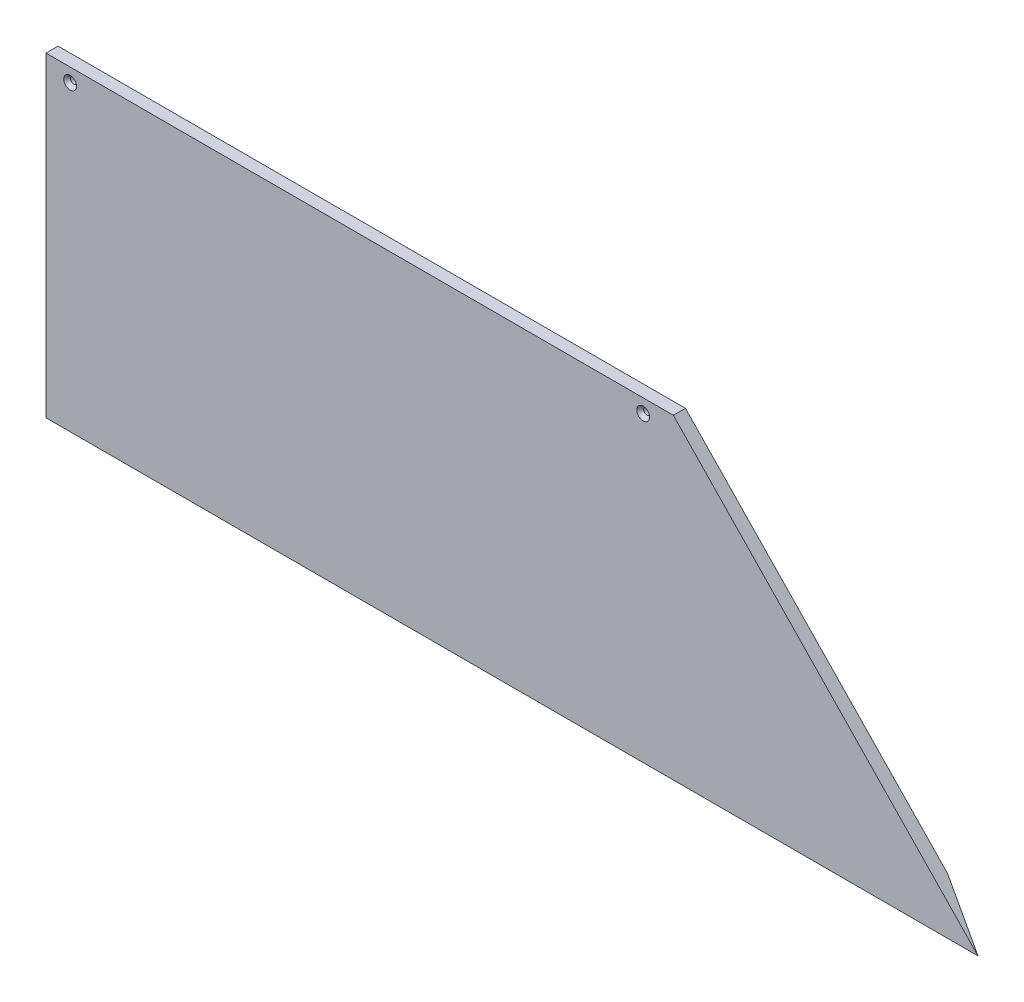
ISO-10303-21;
HEADER;
FILE_DESCRIPTION(('STEP AP214'),'2;1');
FILE_NAME('part.step','',(''),(''),'','','');
FILE_SCHEMA(('AUTOMOTIVE_DESIGN { 1 0 10303 214 1 1 1 1 }'));
ENDSEC;
DATA;
#1=APPLICATION_CONTEXT('core data for automotive mechanical design processes');
#2=APPLICATION_PROTOCOL_DEFINITION('international standard','automotive_design',2000,#1);
#3=PRODUCT_CONTEXT('',#1,'mechanical');
#4=PRODUCT('Part','Part','',(#3));
#5=PRODUCT_RELATED_PRODUCT_CATEGORY('part','',(#4));
#6=PRODUCT_DEFINITION_FORMATION('','',#4);
#7=PRODUCT_DEFINITION_CONTEXT('part definition',#1,'design');
#8=PRODUCT_DEFINITION('design','',#6,#7);
#9=PRODUCT_DEFINITION_SHAPE('','',#8);
#10=(LENGTH_UNIT() NAMED_UNIT(*) SI_UNIT(.MILLI.,.METRE.));
#11=(NAMED_UNIT(*) PLANE_ANGLE_UNIT() SI_UNIT($,.RADIAN.));
#12=(NAMED_UNIT(*) SI_UNIT($,.STERADIAN.) SOLID_ANGLE_UNIT());
#13=UNCERTAINTY_MEASURE_WITH_UNIT(LENGTH_MEASURE(1.E-05),#10,'distance_accuracy_value','');
#14=(GEOMETRIC_REPRESENTATION_CONTEXT(3) GLOBAL_UNCERTAINTY_ASSIGNED_CONTEXT((#13)) GLOBAL_UNIT_ASSIGNED_CONTEXT((#10,
#11,#12)) REPRESENTATION_CONTEXT('',''));
#15=CARTESIAN_POINT('',(0.,0.,0.));
#16=DIRECTION('',(0.,0.,1.));
#17=DIRECTION('',(1.,0.,0.));
#18=AXIS2_PLACEMENT_3D('',#15,#16,#17);
#19=CARTESIAN_POINT('',(820.588283229593,650.830336129829,0.));
#20=DIRECTION('',(0.,0.,1.));
#21=DIRECTION('',(-1.,0.,0.));
#22=AXIS2_PLACEMENT_3D('',#19,#20,#21);
#23=PLANE('',#22);
#24=CARTESIAN_POINT('',(1288.81854000227,297.590703897091,0.));
#25=DIRECTION('',(0.,0.,1.));
#26=DIRECTION('',(0.,-1.,0.));
#27=AXIS2_PLACEMENT_3D('',#24,#25,#26);
#28=CIRCLE('',#27,3.37820000000007);
#29=CARTESIAN_POINT('',(1288.81854000227,294.212503897091,0.));
#30=VERTEX_POINT('',#29);
#31=EDGE_CURVE('E46',#30,#30,#28,.F.);
#32=ORIENTED_EDGE('',*,*,#31,.F.);
#33=EDGE_LOOP('',(#32));
#34=FACE_BOUND('',#33,.T.);
#35=CARTESIAN_POINT('',(685.684270001134,297.590703897091,-1.11022302462516E-13));
#36=DIRECTION('',(0.,0.,1.));
#37=DIRECTION('',(0.,-1.,0.));
#38=AXIS2_PLACEMENT_3D('',#35,#36,#37);
#39=CIRCLE('',#38,3.3782000000001);
#40=CARTESIAN_POINT('',(685.684270001134,294.212503897091,-1.10834774691426E-13));
#41=VERTEX_POINT('',#40);
#42=EDGE_CURVE('E132',#41,#41,#39,.F.);
#43=ORIENTED_EDGE('',*,*,#42,.F.);
#44=EDGE_LOOP('',(#43));
#45=FACE_BOUND('',#44,.T.);
#46=DIRECTION('',(1.,0.,0.));
#47=VECTOR('',#46,1.);
#48=CARTESIAN_POINT('',(820.588283229593,25.6740325966926,0.));
#49=LINE('',#48,#47);
#50=CARTESIAN_POINT('',(660.284270001134,25.6740325966926,0.));
#51=VERTEX_POINT('',#50);
#52=CARTESIAN_POINT('',(1596.56270603019,25.6740325966926,0.));
#53=VERTEX_POINT('',#52);
#54=EDGE_CURVE('E63',#51,#53,#49,.T.);
#55=ORIENTED_EDGE('',*,*,#54,.F.);
#56=DIRECTION('',(0.,-1.,0.));
#57=VECTOR('',#56,1.);
#58=CARTESIAN_POINT('',(660.284270001134,145.643975389749,-1.38777878078145E-13));
#59=LINE('',#58,#57);
#60=CARTESIAN_POINT('',(660.284270001134,311.878203897091,-1.94289029309402E-13));
#61=VERTEX_POINT('',#60);
#62=EDGE_CURVE('E111',#61,#51,#59,.T.);
#63=ORIENTED_EDGE('',*,*,#62,.F.);
#64=DIRECTION('',(-1.,0.,0.));
#65=VECTOR('',#64,1.);
#66=CARTESIAN_POINT('',(990.4264050017,311.878203897091,-2.08166817117217E-13));
#67=LINE('',#66,#65);
#68=CARTESIAN_POINT('',(1320.56854000227,311.878203897091,-2.22044604925031E-13));
#69=VERTEX_POINT('',#68);
#70=EDGE_CURVE('E131',#69,#61,#67,.T.);
#71=ORIENTED_EDGE('',*,*,#70,.F.);
#72=DIRECTION('',(0.694150652110275,-0.719829752215674,0.));
#73=VECTOR('',#72,1.);
#74=CARTESIAN_POINT('',(1480.87255323073,145.643975389749,-2.1163626406917E-13));
#75=LINE('',#74,#73);
#76=EDGE_CURVE('E52',#69,#53,#75,.T.);
#77=ORIENTED_EDGE('',*,*,#76,.T.);
#78=EDGE_LOOP('',(#55,#63,#71,#77));
#79=FACE_BOUND('',#78,.T.);
#80=ADVANCED_FACE('F42',(#34,#45,#79),#23,.F.);
#81=CARTESIAN_POINT('',(660.284270001134,145.643975389749,12.7019999999998));
#82=DIRECTION('',(-1.,0.,0.));
#83=DIRECTION('',(0.,-0.26471698178117,-0.964326147917118));
#84=AXIS2_PLACEMENT_3D('',#81,#82,#83);
#85=PLANE('',#84);
#86=ORIENTED_EDGE('',*,*,#62,.T.);
#87=DIRECTION('',(0.,-0.964326147917118,0.26471698178117));
#88=VECTOR('',#87,1.);
#89=CARTESIAN_POINT('',(660.284270001134,133.994587907647,-29.7350543990856));
#90=LINE('',#89,#88);
#91=CARTESIAN_POINT('',(660.284270001134,-20.5902531175931,12.6999999999999));
#92=VERTEX_POINT('',#91);
#93=EDGE_CURVE('E100',#51,#92,#90,.T.);
#94=ORIENTED_EDGE('',*,*,#93,.T.);
#95=DIRECTION('',(0.,-1.,0.));
#96=VECTOR('',#95,1.);
#97=CARTESIAN_POINT('',(660.284270001134,145.643975389749,12.6999999999999));
#98=LINE('',#97,#96);
#99=CARTESIAN_POINT('',(660.284270001134,311.878203897091,12.6999999999999));
#100=VERTEX_POINT('',#99);
#101=EDGE_CURVE('E108',#100,#92,#98,.T.);
#102=ORIENTED_EDGE('',*,*,#101,.F.);
#103=DIRECTION('',(0.,0.,-1.));
#104=VECTOR('',#103,1.);
#105=CARTESIAN_POINT('',(660.284270001134,311.878203897091,12.7019999999998));
#106=LINE('',#105,#104);
#107=EDGE_CURVE('E75',#100,#61,#106,.T.);
#108=ORIENTED_EDGE('',*,*,#107,.T.);
#109=EDGE_LOOP('',(#86,#94,#102,#108));
#110=FACE_BOUND('',#109,.T.);
#111=ADVANCED_FACE('F107',(#110),#85,.T.);
#112=CARTESIAN_POINT('',(1480.87255323073,145.643975389749,12.7019999999998));
#113=DIRECTION('',(-0.719829752215675,-0.694150652110276,0.));
#114=DIRECTION('',(-0.680983159335232,0.706175147076652,-0.193852001158297));
#115=AXIS2_PLACEMENT_3D('',#112,#113,#114);
#116=PLANE('',#115);
#117=DIRECTION('',(0.680983159335232,-0.706175147076652,0.193852001158297));
#118=VECTOR('',#117,1.);
#119=CARTESIAN_POINT('',(1486.89681737812,139.396852297207,-31.2180289373962));
#120=LINE('',#119,#118);
#121=CARTESIAN_POINT('',(1641.17656645918,-20.590253117593,12.6999999999999));
#122=VERTEX_POINT('',#121);
#123=EDGE_CURVE('E11',#53,#122,#120,.T.);
#124=ORIENTED_EDGE('',*,*,#123,.F.);
#125=ORIENTED_EDGE('',*,*,#76,.F.);
#126=DIRECTION('',(0.,0.,-1.));
#127=VECTOR('',#126,1.);
#128=CARTESIAN_POINT('',(1320.56854000227,311.878203897091,12.7019999999998));
#129=LINE('',#128,#127);
#130=CARTESIAN_POINT('',(1320.56854000227,311.878203897091,12.6999999999998));
#131=VERTEX_POINT('',#130);
#132=EDGE_CURVE('E129',#131,#69,#129,.T.);
#133=ORIENTED_EDGE('',*,*,#132,.F.);
#134=DIRECTION('',(0.694150652110275,-0.719829752215674,0.));
#135=VECTOR('',#134,1.);
#136=CARTESIAN_POINT('',(1480.87255323073,145.643975389749,12.6999999999998));
#137=LINE('',#136,#135);
#138=EDGE_CURVE('E105',#131,#122,#137,.T.);
#139=ORIENTED_EDGE('',*,*,#138,.T.);
#140=EDGE_LOOP('',(#124,#125,#133,#139));
#141=FACE_BOUND('',#140,.T.);
#142=ADVANCED_FACE('F165',(#141),#116,.F.);
#143=CARTESIAN_POINT('',(-2.23913346286443E-13,315.240109565712,12.6999999999998));
#144=DIRECTION('',(0.,0.,1.));
#145=DIRECTION('',(1.,0.,0.));
#146=AXIS2_PLACEMENT_3D('',#143,#144,#145);
#147=PLANE('',#146);
#148=CARTESIAN_POINT('',(1288.81854000227,297.590703897091,12.6999999999999));
#149=DIRECTION('',(0.,0.,1.));
#150=DIRECTION('',(0.,-1.,0.));
#151=AXIS2_PLACEMENT_3D('',#148,#149,#150);
#152=CIRCLE('',#151,6.74370000000008);
#153=CARTESIAN_POINT('',(1288.81854000227,290.84700389709,12.6999999999999));
#154=VERTEX_POINT('',#153);
#155=EDGE_CURVE('E315',#154,#154,#152,.T.);
#156=ORIENTED_EDGE('',*,*,#155,.F.);
#157=EDGE_LOOP('',(#156));
#158=FACE_BOUND('',#157,.T.);
#159=CARTESIAN_POINT('',(685.684270001134,297.590703897091,12.6999999999998));
#160=DIRECTION('',(0.,0.,1.));
#161=DIRECTION('',(0.,-1.,0.));
#162=AXIS2_PLACEMENT_3D('',#159,#160,#161);
#163=CIRCLE('',#162,6.74370000000008);
#164=CARTESIAN_POINT('',(685.684270001134,290.847003897091,12.6999999999998));
#165=VERTEX_POINT('',#164);
#166=EDGE_CURVE('E145',#165,#165,#163,.T.);
#167=ORIENTED_EDGE('',*,*,#166,.F.);
#168=EDGE_LOOP('',(#167));
#169=FACE_BOUND('',#168,.T.);
#170=DIRECTION('',(-1.,0.,0.));
#171=VECTOR('',#170,1.);
#172=CARTESIAN_POINT('',(990.4264050017,311.878203897091,12.6999999999999));
#173=LINE('',#172,#171);
#174=EDGE_CURVE('E116',#131,#100,#173,.T.);
#175=ORIENTED_EDGE('',*,*,#174,.T.);
#176=ORIENTED_EDGE('',*,*,#101,.T.);
#177=DIRECTION('',(-1.,0.,0.));
#178=VECTOR('',#177,1.);
#179=CARTESIAN_POINT('',(1150.73041823016,-20.5902531175931,12.6999999999999));
#180=LINE('',#179,#178);
#181=EDGE_CURVE('E97',#122,#92,#180,.T.);
#182=ORIENTED_EDGE('',*,*,#181,.F.);
#183=ORIENTED_EDGE('',*,*,#138,.F.);
#184=EDGE_LOOP('',(#175,#176,#182,#183));
#185=FACE_BOUND('',#184,.T.);
#186=ADVANCED_FACE('F114',(#158,#169,#185),#147,.T.);
#187=CARTESIAN_POINT('',(990.4264050017,311.878203897091,12.7019999999998));
#188=DIRECTION('',(0.,1.,0.));
#189=DIRECTION('',(0.,0.,1.));
#190=AXIS2_PLACEMENT_3D('',#187,#188,#189);
#191=PLANE('',#190);
#192=ORIENTED_EDGE('',*,*,#132,.T.);
#193=ORIENTED_EDGE('',*,*,#70,.T.);
#194=ORIENTED_EDGE('',*,*,#107,.F.);
#195=ORIENTED_EDGE('',*,*,#174,.F.);
#196=EDGE_LOOP('',(#192,#193,#194,#195));
#197=FACE_BOUND('',#196,.T.);
#198=ADVANCED_FACE('F44',(#197),#191,.T.);
#199=CARTESIAN_POINT('',(2.13127923513117E-13,640.744619123967,-168.842906105527));
#200=DIRECTION('',(0.,-0.26471698178117,-0.964326147917118));
#201=DIRECTION('',(1.,0.,0.));
#202=AXIS2_PLACEMENT_3D('',#199,#200,#201);
#203=PLANE('',#202);
#204=ORIENTED_EDGE('',*,*,#54,.T.);
#205=ORIENTED_EDGE('',*,*,#123,.T.);
#206=ORIENTED_EDGE('',*,*,#181,.T.);
#207=ORIENTED_EDGE('',*,*,#93,.F.);
#208=EDGE_LOOP('',(#204,#205,#206,#207));
#209=FACE_BOUND('',#208,.T.);
#210=ADVANCED_FACE('F99',(#209),#203,.T.);
#211=CARTESIAN_POINT('',(685.684270001134,297.59070389709,-1678.87938114314));
#212=DIRECTION('',(0.,0.,1.));
#213=DIRECTION('',(0.,-1.,0.));
#214=AXIS2_PLACEMENT_3D('',#211,#212,#213);
#215=CYLINDRICAL_SURFACE('',#214,3.3782000000001);
#216=CARTESIAN_POINT('',(685.684270001134,297.590703897091,8.82843512549744));
#217=DIRECTION('',(0.,0.,1.));
#218=DIRECTION('',(0.,-1.,0.));
#219=AXIS2_PLACEMENT_3D('',#216,#217,#218);
#220=CIRCLE('',#219,3.3782);
#221=CARTESIAN_POINT('',(685.684270001134,294.212503897091,8.82843512549744));
#222=VERTEX_POINT('',#221);
#223=EDGE_CURVE('E135',#222,#222,#220,.T.);
#224=ORIENTED_EDGE('',*,*,#223,.T.);
#225=EDGE_LOOP('',(#224));
#226=FACE_BOUND('',#225,.T.);
#227=ORIENTED_EDGE('',*,*,#42,.T.);
#228=EDGE_LOOP('',(#227));
#229=FACE_BOUND('',#228,.T.);
#230=ADVANCED_FACE('F172',(#226,#229),#215,.F.);
#231=CARTESIAN_POINT('',(685.684270001134,297.590703897091,8.82843512549744));
#232=DIRECTION('',(0.,0.,1.));
#233=DIRECTION('',(0.,-1.,0.));
#234=AXIS2_PLACEMENT_3D('',#231,#232,#233);
#235=CONICAL_SURFACE('',#234,3.37820000000004,0.715584993317674);
#236=ORIENTED_EDGE('',*,*,#166,.T.);
#237=EDGE_LOOP('',(#236));
#238=FACE_BOUND('',#237,.T.);
#239=ORIENTED_EDGE('',*,*,#223,.F.);
#240=EDGE_LOOP('',(#239));
#241=FACE_BOUND('',#240,.T.);
#242=ADVANCED_FACE('F226',(#238,#241),#235,.F.);
#243=CARTESIAN_POINT('',(1288.81854000227,297.59070389709,-1678.87938114314));
#244=DIRECTION('',(0.,0.,1.));
#245=DIRECTION('',(0.,-1.,0.));
#246=AXIS2_PLACEMENT_3D('',#243,#244,#245);
#247=CYLINDRICAL_SURFACE('',#246,3.37820000000007);
#248=CARTESIAN_POINT('',(1288.81854000227,297.590703897091,8.82843512549693));
#249=DIRECTION('',(0.,0.,1.));
#250=DIRECTION('',(0.,-1.,0.));
#251=AXIS2_PLACEMENT_3D('',#248,#249,#250);
#252=CIRCLE('',#251,3.3782);
#253=CARTESIAN_POINT('',(1288.81854000227,294.212503897091,8.82843512549693));
#254=VERTEX_POINT('',#253);
#255=EDGE_CURVE('E270',#254,#254,#252,.T.);
#256=ORIENTED_EDGE('',*,*,#255,.T.);
#257=EDGE_LOOP('',(#256));
#258=FACE_BOUND('',#257,.T.);
#259=ORIENTED_EDGE('',*,*,#31,.T.);
#260=EDGE_LOOP('',(#259));
#261=FACE_BOUND('',#260,.T.);
#262=ADVANCED_FACE('F236',(#258,#261),#247,.F.);
#263=CARTESIAN_POINT('',(1288.81854000227,297.590703897091,8.82843512549693));
#264=DIRECTION('',(0.,0.,1.));
#265=DIRECTION('',(0.,-1.,0.));
#266=AXIS2_PLACEMENT_3D('',#263,#264,#265);
#267=CONICAL_SURFACE('',#266,3.3782,0.715584993317619);
#268=ORIENTED_EDGE('',*,*,#155,.T.);
#269=EDGE_LOOP('',(#268));
#270=FACE_BOUND('',#269,.T.);
#271=ORIENTED_EDGE('',*,*,#255,.F.);
#272=EDGE_LOOP('',(#271));
#273=FACE_BOUND('',#272,.T.);
#274=ADVANCED_FACE('F247',(#270,#273),#267,.F.);
#275=CLOSED_SHELL('',(#80,#111,#142,#186,#198,#210,#230,#242,#262,#274));
#276=MANIFOLD_SOLID_BREP('B2',#275);
#277=ADVANCED_BREP_SHAPE_REPRESENTATION('',(#18,#276),#14);
#278=SHAPE_DEFINITION_REPRESENTATION(#9,#277);
ENDSEC;
END-ISO-10303-21;
